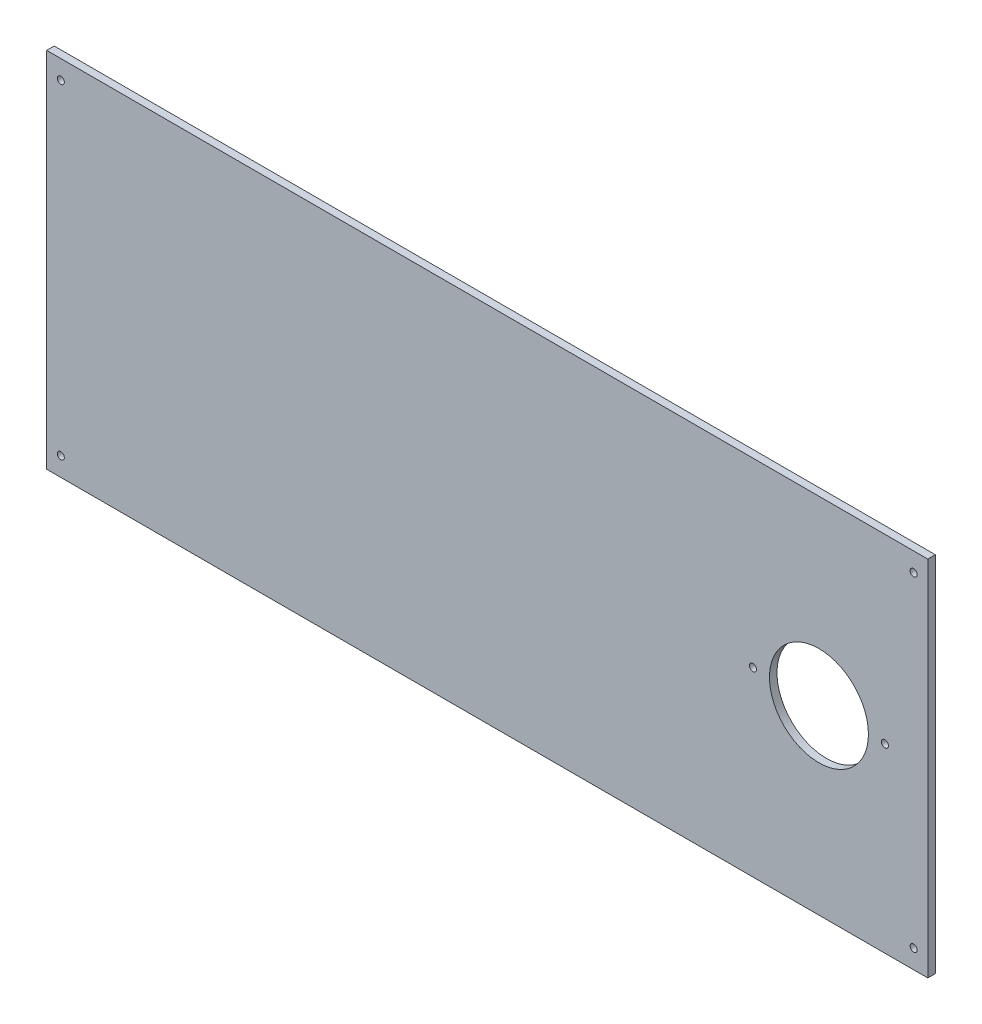
ISO-10303-21;
HEADER;
FILE_DESCRIPTION(('STEP AP214'),'2;1');
FILE_NAME('part.step','',(''),(''),'','','');
FILE_SCHEMA(('AUTOMOTIVE_DESIGN { 1 0 10303 214 1 1 1 1 }'));
ENDSEC;
DATA;
#1=APPLICATION_CONTEXT('core data for automotive mechanical design processes');
#2=APPLICATION_PROTOCOL_DEFINITION('international standard','automotive_design',2000,#1);
#3=PRODUCT_CONTEXT('',#1,'mechanical');
#4=PRODUCT('Part','Part','',(#3));
#5=PRODUCT_RELATED_PRODUCT_CATEGORY('part','',(#4));
#6=PRODUCT_DEFINITION_FORMATION('','',#4);
#7=PRODUCT_DEFINITION_CONTEXT('part definition',#1,'design');
#8=PRODUCT_DEFINITION('design','',#6,#7);
#9=PRODUCT_DEFINITION_SHAPE('','',#8);
#10=(LENGTH_UNIT() NAMED_UNIT(*) SI_UNIT(.MILLI.,.METRE.));
#11=(NAMED_UNIT(*) PLANE_ANGLE_UNIT() SI_UNIT($,.RADIAN.));
#12=(NAMED_UNIT(*) SI_UNIT($,.STERADIAN.) SOLID_ANGLE_UNIT());
#13=UNCERTAINTY_MEASURE_WITH_UNIT(LENGTH_MEASURE(1.E-05),#10,'distance_accuracy_value','');
#14=(GEOMETRIC_REPRESENTATION_CONTEXT(3) GLOBAL_UNCERTAINTY_ASSIGNED_CONTEXT((#13)) GLOBAL_UNIT_ASSIGNED_CONTEXT((#10,
#11,#12)) REPRESENTATION_CONTEXT('',''));
#15=CARTESIAN_POINT('',(0.,0.,0.));
#16=DIRECTION('',(0.,0.,1.));
#17=DIRECTION('',(1.,0.,0.));
#18=AXIS2_PLACEMENT_3D('',#15,#16,#17);
#19=CARTESIAN_POINT('',(0.06942582,-77.06797642,-1.6));
#20=DIRECTION('',(0.,-1.,0.));
#21=DIRECTION('',(0.,0.,-1.));
#22=AXIS2_PLACEMENT_3D('',#19,#20,#21);
#23=PLANE('',#22);
#24=DIRECTION('',(1.,0.,0.));
#25=VECTOR('',#24,1.);
#26=CARTESIAN_POINT('',(0.06942582,-77.06797642,0.));
#27=LINE('',#26,#25);
#28=CARTESIAN_POINT('',(0.06942582,-77.06797642,0.));
#29=VERTEX_POINT('',#28);
#30=CARTESIAN_POINT('',(187.06940742,-77.06797642,0.));
#31=VERTEX_POINT('',#30);
#32=EDGE_CURVE('E99',#29,#31,#27,.T.);
#33=ORIENTED_EDGE('',*,*,#32,.F.);
#34=DIRECTION('',(0.,0.,1.));
#35=VECTOR('',#34,1.);
#36=CARTESIAN_POINT('',(0.06942582,-77.06797642,-1.6));
#37=LINE('',#36,#35);
#38=CARTESIAN_POINT('',(0.06942582,-77.06797642,-1.6));
#39=VERTEX_POINT('',#38);
#40=EDGE_CURVE('E11',#39,#29,#37,.T.);
#41=ORIENTED_EDGE('',*,*,#40,.F.);
#42=DIRECTION('',(1.,0.,0.));
#43=VECTOR('',#42,1.);
#44=CARTESIAN_POINT('',(0.06942582,-77.06797642,-1.6));
#45=LINE('',#44,#43);
#46=CARTESIAN_POINT('',(187.06940742,-77.06797642,-1.6));
#47=VERTEX_POINT('',#46);
#48=EDGE_CURVE('E92',#39,#47,#45,.T.);
#49=ORIENTED_EDGE('',*,*,#48,.T.);
#50=DIRECTION('',(0.,0.,1.));
#51=VECTOR('',#50,1.);
#52=CARTESIAN_POINT('',(187.06940742,-77.06797642,-1.6));
#53=LINE('',#52,#51);
#54=EDGE_CURVE('E37',#47,#31,#53,.T.);
#55=ORIENTED_EDGE('',*,*,#54,.T.);
#56=EDGE_LOOP('',(#33,#41,#49,#55));
#57=FACE_BOUND('',#56,.T.);
#58=ADVANCED_FACE('F34',(#57),#23,.T.);
#59=CARTESIAN_POINT('',(0.06942582,-77.06797642,-1.6));
#60=DIRECTION('',(-1.,0.,0.));
#61=DIRECTION('',(0.,0.,1.));
#62=AXIS2_PLACEMENT_3D('',#59,#60,#61);
#63=PLANE('',#62);
#64=DIRECTION('',(0.,-1.,0.));
#65=VECTOR('',#64,1.);
#66=CARTESIAN_POINT('',(0.06942582,-77.06797642,0.));
#67=LINE('',#66,#65);
#68=CARTESIAN_POINT('',(0.06942582,-0.06797802,0.));
#69=VERTEX_POINT('',#68);
#70=EDGE_CURVE('E94',#69,#29,#67,.T.);
#71=ORIENTED_EDGE('',*,*,#70,.F.);
#72=DIRECTION('',(0.,0.,1.));
#73=VECTOR('',#72,1.);
#74=CARTESIAN_POINT('',(0.06942582,-0.06797802,-1.6));
#75=LINE('',#74,#73);
#76=CARTESIAN_POINT('',(0.06942582,-0.06797802,-1.6));
#77=VERTEX_POINT('',#76);
#78=EDGE_CURVE('E43',#77,#69,#75,.T.);
#79=ORIENTED_EDGE('',*,*,#78,.F.);
#80=DIRECTION('',(0.,-1.,0.));
#81=VECTOR('',#80,1.);
#82=CARTESIAN_POINT('',(0.06942582,-77.06797642,-1.6));
#83=LINE('',#82,#81);
#84=EDGE_CURVE('E89',#77,#39,#83,.T.);
#85=ORIENTED_EDGE('',*,*,#84,.T.);
#86=ORIENTED_EDGE('',*,*,#40,.T.);
#87=EDGE_LOOP('',(#71,#79,#85,#86));
#88=FACE_BOUND('',#87,.T.);
#89=ADVANCED_FACE('F110',(#88),#63,.T.);
#90=CARTESIAN_POINT('',(0.06942582,-0.06797802,-1.6));
#91=DIRECTION('',(0.,1.,0.));
#92=DIRECTION('',(0.,0.,1.));
#93=AXIS2_PLACEMENT_3D('',#90,#91,#92);
#94=PLANE('',#93);
#95=DIRECTION('',(-1.,0.,0.));
#96=VECTOR('',#95,1.);
#97=CARTESIAN_POINT('',(0.06942582,-0.06797802,0.));
#98=LINE('',#97,#96);
#99=CARTESIAN_POINT('',(187.06940742,-0.06797802,0.));
#100=VERTEX_POINT('',#99);
#101=EDGE_CURVE('E84',#100,#69,#98,.T.);
#102=ORIENTED_EDGE('',*,*,#101,.F.);
#103=DIRECTION('',(0.,0.,1.));
#104=VECTOR('',#103,1.);
#105=CARTESIAN_POINT('',(187.06940742,-0.06797802,-1.6));
#106=LINE('',#105,#104);
#107=CARTESIAN_POINT('',(187.06940742,-0.06797802,-1.6));
#108=VERTEX_POINT('',#107);
#109=EDGE_CURVE('E79',#108,#100,#106,.T.);
#110=ORIENTED_EDGE('',*,*,#109,.F.);
#111=DIRECTION('',(-1.,0.,0.));
#112=VECTOR('',#111,1.);
#113=CARTESIAN_POINT('',(0.06942582,-0.06797802,-1.6));
#114=LINE('',#113,#112);
#115=EDGE_CURVE('E82',#108,#77,#114,.T.);
#116=ORIENTED_EDGE('',*,*,#115,.T.);
#117=ORIENTED_EDGE('',*,*,#78,.T.);
#118=EDGE_LOOP('',(#102,#110,#116,#117));
#119=FACE_BOUND('',#118,.T.);
#120=ADVANCED_FACE('F81',(#119),#94,.T.);
#121=CARTESIAN_POINT('',(187.06940742,-77.06797642,-1.6));
#122=DIRECTION('',(1.,0.,0.));
#123=DIRECTION('',(0.,0.,-1.));
#124=AXIS2_PLACEMENT_3D('',#121,#122,#123);
#125=PLANE('',#124);
#126=DIRECTION('',(0.,1.,0.));
#127=VECTOR('',#126,1.);
#128=CARTESIAN_POINT('',(187.06940742,-77.06797642,0.));
#129=LINE('',#128,#127);
#130=EDGE_CURVE('E102',#31,#100,#129,.T.);
#131=ORIENTED_EDGE('',*,*,#130,.F.);
#132=ORIENTED_EDGE('',*,*,#54,.F.);
#133=DIRECTION('',(0.,1.,0.));
#134=VECTOR('',#133,1.);
#135=CARTESIAN_POINT('',(187.06940742,-77.06797642,-1.6));
#136=LINE('',#135,#134);
#137=EDGE_CURVE('E88',#47,#108,#136,.T.);
#138=ORIENTED_EDGE('',*,*,#137,.T.);
#139=ORIENTED_EDGE('',*,*,#109,.T.);
#140=EDGE_LOOP('',(#131,#132,#138,#139));
#141=FACE_BOUND('',#140,.T.);
#142=ADVANCED_FACE('F91',(#141),#125,.T.);
#143=CARTESIAN_POINT('',(0.,0.,-1.6));
#144=DIRECTION('',(0.,0.,1.));
#145=DIRECTION('',(1.,0.,0.));
#146=AXIS2_PLACEMENT_3D('',#143,#144,#145);
#147=PLANE('',#146);
#148=CARTESIAN_POINT('',(149.96940542,-38.56797722,-1.6));
#149=DIRECTION('',(0.,0.,1.));
#150=DIRECTION('',(1.,0.,0.));
#151=AXIS2_PLACEMENT_3D('',#148,#149,#150);
#152=CIRCLE('',#151,0.749998499999988);
#153=CARTESIAN_POINT('',(150.71940392,-38.56797722,-1.6));
#154=VERTEX_POINT('',#153);
#155=EDGE_CURVE('E186',#154,#154,#152,.T.);
#156=ORIENTED_EDGE('',*,*,#155,.T.);
#157=EDGE_LOOP('',(#156));
#158=FACE_BOUND('',#157,.T.);
#159=CARTESIAN_POINT('',(184.06940072,-4.0680005,-1.6));
#160=DIRECTION('',(0.,0.,1.));
#161=DIRECTION('',(1.,0.,0.));
#162=AXIS2_PLACEMENT_3D('',#159,#160,#161);
#163=CIRCLE('',#162,0.749998500000015);
#164=CARTESIAN_POINT('',(184.81939922,-4.0680005,-1.6));
#165=VERTEX_POINT('',#164);
#166=EDGE_CURVE('E179',#165,#165,#163,.T.);
#167=ORIENTED_EDGE('',*,*,#166,.T.);
#168=EDGE_LOOP('',(#167));
#169=FACE_BOUND('',#168,.T.);
#170=CARTESIAN_POINT('',(184.06940072,-73.06799966,-1.6));
#171=DIRECTION('',(0.,0.,1.));
#172=DIRECTION('',(1.,0.,0.));
#173=AXIS2_PLACEMENT_3D('',#170,#171,#172);
#174=CIRCLE('',#173,0.749998500000015);
#175=CARTESIAN_POINT('',(184.81939922,-73.06799966,-1.6));
#176=VERTEX_POINT('',#175);
#177=EDGE_CURVE('E197',#176,#176,#174,.T.);
#178=ORIENTED_EDGE('',*,*,#177,.T.);
#179=EDGE_LOOP('',(#178));
#180=FACE_BOUND('',#179,.T.);
#181=CARTESIAN_POINT('',(3.0693995,-4.0680005,-1.6));
#182=DIRECTION('',(0.,0.,1.));
#183=DIRECTION('',(1.,0.,0.));
#184=AXIS2_PLACEMENT_3D('',#181,#182,#183);
#185=CIRCLE('',#184,0.7499985);
#186=CARTESIAN_POINT('',(3.819398,-4.0680005,-1.6));
#187=VERTEX_POINT('',#186);
#188=EDGE_CURVE('E190',#187,#187,#185,.T.);
#189=ORIENTED_EDGE('',*,*,#188,.T.);
#190=EDGE_LOOP('',(#189));
#191=FACE_BOUND('',#190,.T.);
#192=CARTESIAN_POINT('',(177.96940022,-38.56797722,-1.6));
#193=DIRECTION('',(0.,0.,1.));
#194=DIRECTION('',(1.,0.,0.));
#195=AXIS2_PLACEMENT_3D('',#192,#193,#194);
#196=CIRCLE('',#195,0.749998499999988);
#197=CARTESIAN_POINT('',(178.71939872,-38.56797722,-1.6));
#198=VERTEX_POINT('',#197);
#199=EDGE_CURVE('E164',#198,#198,#196,.T.);
#200=ORIENTED_EDGE('',*,*,#199,.T.);
#201=EDGE_LOOP('',(#200));
#202=FACE_BOUND('',#201,.T.);
#203=CARTESIAN_POINT('',(163.96937742,-38.56797722,-1.6));
#204=DIRECTION('',(0.,0.,1.));
#205=DIRECTION('',(1.,0.,0.));
#206=AXIS2_PLACEMENT_3D('',#203,#204,#205);
#207=CIRCLE('',#206,10.5);
#208=CARTESIAN_POINT('',(174.46937742,-38.56797722,-1.6));
#209=VERTEX_POINT('',#208);
#210=EDGE_CURVE('E169',#209,#209,#207,.T.);
#211=ORIENTED_EDGE('',*,*,#210,.T.);
#212=EDGE_LOOP('',(#211));
#213=FACE_BOUND('',#212,.T.);
#214=CARTESIAN_POINT('',(3.0693995,-73.06799966,-1.6));
#215=DIRECTION('',(0.,0.,1.));
#216=DIRECTION('',(1.,0.,0.));
#217=AXIS2_PLACEMENT_3D('',#214,#215,#216);
#218=CIRCLE('',#217,0.7499985);
#219=CARTESIAN_POINT('',(3.819398,-73.06799966,-1.6));
#220=VERTEX_POINT('',#219);
#221=EDGE_CURVE('E103',#220,#220,#218,.T.);
#222=ORIENTED_EDGE('',*,*,#221,.T.);
#223=EDGE_LOOP('',(#222));
#224=FACE_BOUND('',#223,.T.);
#225=ORIENTED_EDGE('',*,*,#48,.F.);
#226=ORIENTED_EDGE('',*,*,#84,.F.);
#227=ORIENTED_EDGE('',*,*,#115,.F.);
#228=ORIENTED_EDGE('',*,*,#137,.F.);
#229=EDGE_LOOP('',(#225,#226,#227,#228));
#230=FACE_BOUND('',#229,.T.);
#231=ADVANCED_FACE('F87',(#158,#169,#180,#191,#202,#213,#224,#230),#147,.F.);
#232=CARTESIAN_POINT('',(0.,0.,0.));
#233=DIRECTION('',(0.,0.,1.));
#234=DIRECTION('',(1.,0.,0.));
#235=AXIS2_PLACEMENT_3D('',#232,#233,#234);
#236=PLANE('',#235);
#237=CARTESIAN_POINT('',(149.96940542,-38.56797722,0.));
#238=DIRECTION('',(0.,0.,1.));
#239=DIRECTION('',(1.,0.,0.));
#240=AXIS2_PLACEMENT_3D('',#237,#238,#239);
#241=CIRCLE('',#240,0.749998499999988);
#242=CARTESIAN_POINT('',(150.71940392,-38.56797722,0.));
#243=VERTEX_POINT('',#242);
#244=EDGE_CURVE('E171',#243,#243,#241,.T.);
#245=ORIENTED_EDGE('',*,*,#244,.F.);
#246=EDGE_LOOP('',(#245));
#247=FACE_BOUND('',#246,.T.);
#248=CARTESIAN_POINT('',(184.06940072,-4.0680005,0.));
#249=DIRECTION('',(0.,0.,1.));
#250=DIRECTION('',(1.,0.,0.));
#251=AXIS2_PLACEMENT_3D('',#248,#249,#250);
#252=CIRCLE('',#251,0.749998500000015);
#253=CARTESIAN_POINT('',(184.81939922,-4.0680005,0.));
#254=VERTEX_POINT('',#253);
#255=EDGE_CURVE('E183',#254,#254,#252,.T.);
#256=ORIENTED_EDGE('',*,*,#255,.F.);
#257=EDGE_LOOP('',(#256));
#258=FACE_BOUND('',#257,.T.);
#259=CARTESIAN_POINT('',(184.06940072,-73.06799966,0.));
#260=DIRECTION('',(0.,0.,1.));
#261=DIRECTION('',(1.,0.,0.));
#262=AXIS2_PLACEMENT_3D('',#259,#260,#261);
#263=CIRCLE('',#262,0.749998500000015);
#264=CARTESIAN_POINT('',(184.81939922,-73.06799966,0.));
#265=VERTEX_POINT('',#264);
#266=EDGE_CURVE('E182',#265,#265,#263,.T.);
#267=ORIENTED_EDGE('',*,*,#266,.F.);
#268=EDGE_LOOP('',(#267));
#269=FACE_BOUND('',#268,.T.);
#270=CARTESIAN_POINT('',(3.0693995,-4.0680005,0.));
#271=DIRECTION('',(0.,0.,1.));
#272=DIRECTION('',(1.,0.,0.));
#273=AXIS2_PLACEMENT_3D('',#270,#271,#272);
#274=CIRCLE('',#273,0.7499985);
#275=CARTESIAN_POINT('',(3.819398,-4.0680005,0.));
#276=VERTEX_POINT('',#275);
#277=EDGE_CURVE('E194',#276,#276,#274,.T.);
#278=ORIENTED_EDGE('',*,*,#277,.F.);
#279=EDGE_LOOP('',(#278));
#280=FACE_BOUND('',#279,.T.);
#281=CARTESIAN_POINT('',(177.96940022,-38.56797722,0.));
#282=DIRECTION('',(0.,0.,1.));
#283=DIRECTION('',(1.,0.,0.));
#284=AXIS2_PLACEMENT_3D('',#281,#282,#283);
#285=CIRCLE('',#284,0.749998499999988);
#286=CARTESIAN_POINT('',(178.71939872,-38.56797722,0.));
#287=VERTEX_POINT('',#286);
#288=EDGE_CURVE('E167',#287,#287,#285,.T.);
#289=ORIENTED_EDGE('',*,*,#288,.F.);
#290=EDGE_LOOP('',(#289));
#291=FACE_BOUND('',#290,.T.);
#292=CARTESIAN_POINT('',(163.96937742,-38.56797722,0.));
#293=DIRECTION('',(0.,0.,1.));
#294=DIRECTION('',(1.,0.,0.));
#295=AXIS2_PLACEMENT_3D('',#292,#293,#294);
#296=CIRCLE('',#295,10.5);
#297=CARTESIAN_POINT('',(174.46937742,-38.56797722,0.));
#298=VERTEX_POINT('',#297);
#299=EDGE_CURVE('E174',#298,#298,#296,.T.);
#300=ORIENTED_EDGE('',*,*,#299,.F.);
#301=EDGE_LOOP('',(#300));
#302=FACE_BOUND('',#301,.T.);
#303=CARTESIAN_POINT('',(3.0693995,-73.06799966,0.));
#304=DIRECTION('',(0.,0.,1.));
#305=DIRECTION('',(1.,0.,0.));
#306=AXIS2_PLACEMENT_3D('',#303,#304,#305);
#307=CIRCLE('',#306,0.7499985);
#308=CARTESIAN_POINT('',(3.819398,-73.06799966,0.));
#309=VERTEX_POINT('',#308);
#310=EDGE_CURVE('E193',#309,#309,#307,.T.);
#311=ORIENTED_EDGE('',*,*,#310,.F.);
#312=EDGE_LOOP('',(#311));
#313=FACE_BOUND('',#312,.T.);
#314=ORIENTED_EDGE('',*,*,#32,.T.);
#315=ORIENTED_EDGE('',*,*,#130,.T.);
#316=ORIENTED_EDGE('',*,*,#101,.T.);
#317=ORIENTED_EDGE('',*,*,#70,.T.);
#318=EDGE_LOOP('',(#314,#315,#316,#317));
#319=FACE_BOUND('',#318,.T.);
#320=ADVANCED_FACE('F109',(#247,#258,#269,#280,#291,#302,#313,#319),#236,.T.);
#321=CARTESIAN_POINT('',(3.0693995,-73.06799966,-1.6));
#322=DIRECTION('',(0.,0.,1.));
#323=DIRECTION('',(1.,0.,0.));
#324=AXIS2_PLACEMENT_3D('',#321,#322,#323);
#325=CYLINDRICAL_SURFACE('',#324,0.7499985);
#326=ORIENTED_EDGE('',*,*,#221,.F.);
#327=EDGE_LOOP('',(#326));
#328=FACE_BOUND('',#327,.T.);
#329=ORIENTED_EDGE('',*,*,#310,.T.);
#330=EDGE_LOOP('',(#329));
#331=FACE_BOUND('',#330,.T.);
#332=ADVANCED_FACE('F128',(#328,#331),#325,.F.);
#333=CARTESIAN_POINT('',(163.96937742,-38.56797722,-1.6));
#334=DIRECTION('',(0.,0.,1.));
#335=DIRECTION('',(1.,0.,0.));
#336=AXIS2_PLACEMENT_3D('',#333,#334,#335);
#337=CYLINDRICAL_SURFACE('',#336,10.5);
#338=ORIENTED_EDGE('',*,*,#210,.F.);
#339=EDGE_LOOP('',(#338));
#340=FACE_BOUND('',#339,.T.);
#341=ORIENTED_EDGE('',*,*,#299,.T.);
#342=EDGE_LOOP('',(#341));
#343=FACE_BOUND('',#342,.T.);
#344=ADVANCED_FACE('F135',(#340,#343),#337,.F.);
#345=CARTESIAN_POINT('',(177.96940022,-38.56797722,-1.6));
#346=DIRECTION('',(0.,0.,1.));
#347=DIRECTION('',(1.,0.,0.));
#348=AXIS2_PLACEMENT_3D('',#345,#346,#347);
#349=CYLINDRICAL_SURFACE('',#348,0.749998499999988);
#350=ORIENTED_EDGE('',*,*,#199,.F.);
#351=EDGE_LOOP('',(#350));
#352=FACE_BOUND('',#351,.T.);
#353=ORIENTED_EDGE('',*,*,#288,.T.);
#354=EDGE_LOOP('',(#353));
#355=FACE_BOUND('',#354,.T.);
#356=ADVANCED_FACE('F145',(#352,#355),#349,.F.);
#357=CARTESIAN_POINT('',(3.0693995,-4.0680005,-1.6));
#358=DIRECTION('',(0.,0.,1.));
#359=DIRECTION('',(1.,0.,0.));
#360=AXIS2_PLACEMENT_3D('',#357,#358,#359);
#361=CYLINDRICAL_SURFACE('',#360,0.7499985);
#362=ORIENTED_EDGE('',*,*,#188,.F.);
#363=EDGE_LOOP('',(#362));
#364=FACE_BOUND('',#363,.T.);
#365=ORIENTED_EDGE('',*,*,#277,.T.);
#366=EDGE_LOOP('',(#365));
#367=FACE_BOUND('',#366,.T.);
#368=ADVANCED_FACE('F141',(#364,#367),#361,.F.);
#369=CARTESIAN_POINT('',(184.06940072,-73.06799966,-1.6));
#370=DIRECTION('',(0.,0.,1.));
#371=DIRECTION('',(1.,0.,0.));
#372=AXIS2_PLACEMENT_3D('',#369,#370,#371);
#373=CYLINDRICAL_SURFACE('',#372,0.749998500000015);
#374=ORIENTED_EDGE('',*,*,#177,.F.);
#375=EDGE_LOOP('',(#374));
#376=FACE_BOUND('',#375,.T.);
#377=ORIENTED_EDGE('',*,*,#266,.T.);
#378=EDGE_LOOP('',(#377));
#379=FACE_BOUND('',#378,.T.);
#380=ADVANCED_FACE('F137',(#376,#379),#373,.F.);
#381=CARTESIAN_POINT('',(184.06940072,-4.0680005,-1.6));
#382=DIRECTION('',(0.,0.,1.));
#383=DIRECTION('',(1.,0.,0.));
#384=AXIS2_PLACEMENT_3D('',#381,#382,#383);
#385=CYLINDRICAL_SURFACE('',#384,0.749998500000015);
#386=ORIENTED_EDGE('',*,*,#166,.F.);
#387=EDGE_LOOP('',(#386));
#388=FACE_BOUND('',#387,.T.);
#389=ORIENTED_EDGE('',*,*,#255,.T.);
#390=EDGE_LOOP('',(#389));
#391=FACE_BOUND('',#390,.T.);
#392=ADVANCED_FACE('F140',(#388,#391),#385,.F.);
#393=CARTESIAN_POINT('',(149.96940542,-38.56797722,-1.6));
#394=DIRECTION('',(0.,0.,1.));
#395=DIRECTION('',(1.,0.,0.));
#396=AXIS2_PLACEMENT_3D('',#393,#394,#395);
#397=CYLINDRICAL_SURFACE('',#396,0.749998499999988);
#398=ORIENTED_EDGE('',*,*,#155,.F.);
#399=EDGE_LOOP('',(#398));
#400=FACE_BOUND('',#399,.T.);
#401=ORIENTED_EDGE('',*,*,#244,.T.);
#402=EDGE_LOOP('',(#401));
#403=FACE_BOUND('',#402,.T.);
#404=ADVANCED_FACE('F147',(#400,#403),#397,.F.);
#405=CLOSED_SHELL('',(#58,#89,#120,#142,#231,#320,#332,#344,#356,#368,#380,#392,#404));
#406=MANIFOLD_SOLID_BREP('B2',#405);
#407=ADVANCED_BREP_SHAPE_REPRESENTATION('',(#18,#406),#14);
#408=SHAPE_DEFINITION_REPRESENTATION(#9,#407);
ENDSEC;
END-ISO-10303-21;
